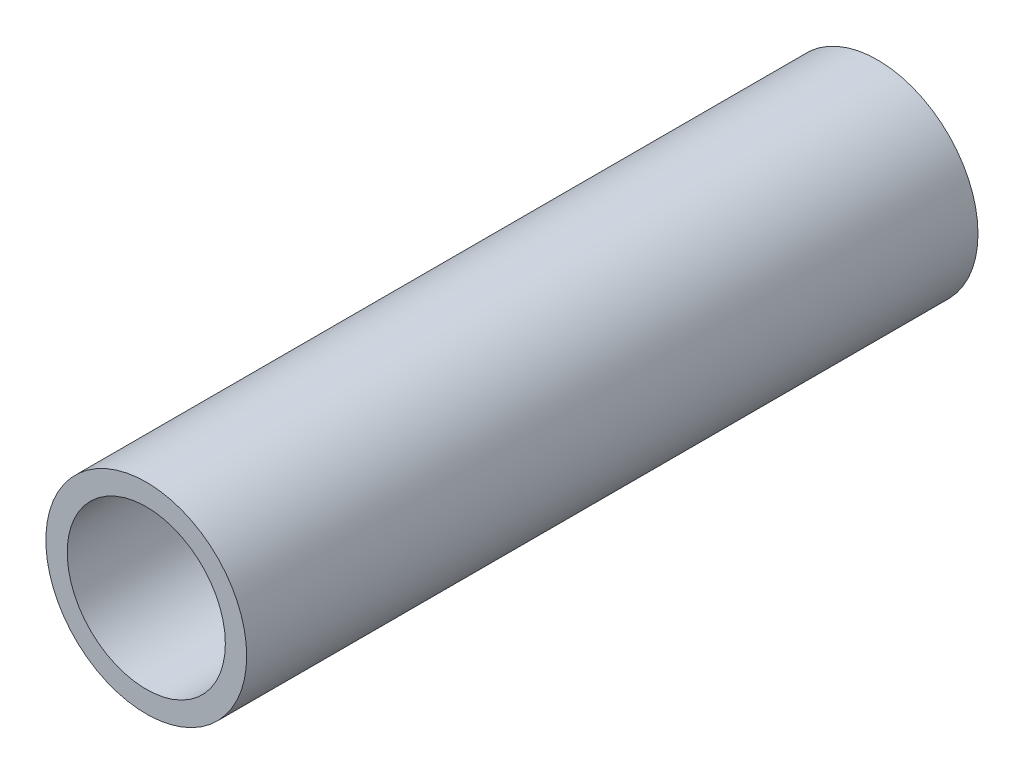
ISO-10303-21;
HEADER;
FILE_DESCRIPTION(('STEP AP214'),'2;1');
FILE_NAME('part.step','',(''),(''),'','','');
FILE_SCHEMA(('AUTOMOTIVE_DESIGN { 1 0 10303 214 1 1 1 1 }'));
ENDSEC;
DATA;
#1=APPLICATION_CONTEXT('core data for automotive mechanical design processes');
#2=APPLICATION_PROTOCOL_DEFINITION('international standard','automotive_design',2000,#1);
#3=PRODUCT_CONTEXT('',#1,'mechanical');
#4=PRODUCT('Part','Part','',(#3));
#5=PRODUCT_RELATED_PRODUCT_CATEGORY('part','',(#4));
#6=PRODUCT_DEFINITION_FORMATION('','',#4);
#7=PRODUCT_DEFINITION_CONTEXT('part definition',#1,'design');
#8=PRODUCT_DEFINITION('design','',#6,#7);
#9=PRODUCT_DEFINITION_SHAPE('','',#8);
#10=(LENGTH_UNIT() NAMED_UNIT(*) SI_UNIT(.MILLI.,.METRE.));
#11=(NAMED_UNIT(*) PLANE_ANGLE_UNIT() SI_UNIT($,.RADIAN.));
#12=(NAMED_UNIT(*) SI_UNIT($,.STERADIAN.) SOLID_ANGLE_UNIT());
#13=UNCERTAINTY_MEASURE_WITH_UNIT(LENGTH_MEASURE(1.E-05),#10,'distance_accuracy_value','');
#14=(GEOMETRIC_REPRESENTATION_CONTEXT(3) GLOBAL_UNCERTAINTY_ASSIGNED_CONTEXT((#13)) GLOBAL_UNIT_ASSIGNED_CONTEXT((#10,
#11,#12)) REPRESENTATION_CONTEXT('',''));
#15=CARTESIAN_POINT('',(0.,0.,0.));
#16=DIRECTION('',(0.,0.,1.));
#17=DIRECTION('',(1.,0.,0.));
#18=AXIS2_PLACEMENT_3D('',#15,#16,#17);
#19=CARTESIAN_POINT('',(0.,0.,29.13));
#20=DIRECTION('',(0.,0.,1.));
#21=DIRECTION('',(1.,0.,0.));
#22=AXIS2_PLACEMENT_3D('',#19,#20,#21);
#23=PLANE('',#22);
#24=CARTESIAN_POINT('',(0.,0.,29.13));
#25=DIRECTION('',(0.,0.,1.));
#26=DIRECTION('',(1.,0.,0.));
#27=AXIS2_PLACEMENT_3D('',#24,#25,#26);
#28=CIRCLE('',#27,4.);
#29=CARTESIAN_POINT('',(4.,0.,29.13));
#30=VERTEX_POINT('',#29);
#31=EDGE_CURVE('E10',#30,#30,#28,.T.);
#32=ORIENTED_EDGE('',*,*,#31,.T.);
#33=EDGE_LOOP('',(#32));
#34=FACE_BOUND('',#33,.T.);
#35=CARTESIAN_POINT('',(0.,0.,29.13));
#36=DIRECTION('',(0.,0.,1.));
#37=DIRECTION('',(1.,0.,0.));
#38=AXIS2_PLACEMENT_3D('',#35,#36,#37);
#39=CIRCLE('',#38,3.15);
#40=CARTESIAN_POINT('',(3.15,0.,29.13));
#41=VERTEX_POINT('',#40);
#42=EDGE_CURVE('E45',#41,#41,#39,.T.);
#43=ORIENTED_EDGE('',*,*,#42,.F.);
#44=EDGE_LOOP('',(#43));
#45=FACE_BOUND('',#44,.T.);
#46=ADVANCED_FACE('F34',(#34,#45),#23,.T.);
#47=CARTESIAN_POINT('',(0.,0.,0.));
#48=DIRECTION('',(0.,0.,1.));
#49=DIRECTION('',(1.,0.,0.));
#50=AXIS2_PLACEMENT_3D('',#47,#48,#49);
#51=PLANE('',#50);
#52=CARTESIAN_POINT('',(0.,0.,0.));
#53=DIRECTION('',(0.,0.,1.));
#54=DIRECTION('',(1.,0.,0.));
#55=AXIS2_PLACEMENT_3D('',#52,#53,#54);
#56=CIRCLE('',#55,4.);
#57=CARTESIAN_POINT('',(4.,0.,0.));
#58=VERTEX_POINT('',#57);
#59=EDGE_CURVE('E38',#58,#58,#56,.T.);
#60=ORIENTED_EDGE('',*,*,#59,.F.);
#61=EDGE_LOOP('',(#60));
#62=FACE_BOUND('',#61,.T.);
#63=CARTESIAN_POINT('',(0.,0.,0.));
#64=DIRECTION('',(0.,0.,1.));
#65=DIRECTION('',(1.,0.,0.));
#66=AXIS2_PLACEMENT_3D('',#63,#64,#65);
#67=CIRCLE('',#66,3.15);
#68=CARTESIAN_POINT('',(3.15,0.,0.));
#69=VERTEX_POINT('',#68);
#70=EDGE_CURVE('E47',#69,#69,#67,.T.);
#71=ORIENTED_EDGE('',*,*,#70,.T.);
#72=EDGE_LOOP('',(#71));
#73=FACE_BOUND('',#72,.T.);
#74=ADVANCED_FACE('F57',(#62,#73),#51,.F.);
#75=CARTESIAN_POINT('',(0.,0.,29.13));
#76=DIRECTION('',(0.,0.,-1.));
#77=DIRECTION('',(-1.,0.,0.));
#78=AXIS2_PLACEMENT_3D('',#75,#76,#77);
#79=CYLINDRICAL_SURFACE('',#78,4.);
#80=ORIENTED_EDGE('',*,*,#31,.F.);
#81=EDGE_LOOP('',(#80));
#82=FACE_BOUND('',#81,.T.);
#83=ORIENTED_EDGE('',*,*,#59,.T.);
#84=EDGE_LOOP('',(#83));
#85=FACE_BOUND('',#84,.T.);
#86=ADVANCED_FACE('F36',(#82,#85),#79,.T.);
#87=CARTESIAN_POINT('',(0.,0.,29.13));
#88=DIRECTION('',(0.,0.,-1.));
#89=DIRECTION('',(-1.,0.,0.));
#90=AXIS2_PLACEMENT_3D('',#87,#88,#89);
#91=CYLINDRICAL_SURFACE('',#90,3.15);
#92=ORIENTED_EDGE('',*,*,#42,.T.);
#93=EDGE_LOOP('',(#92));
#94=FACE_BOUND('',#93,.T.);
#95=ORIENTED_EDGE('',*,*,#70,.F.);
#96=EDGE_LOOP('',(#95));
#97=FACE_BOUND('',#96,.T.);
#98=ADVANCED_FACE('F53',(#94,#97),#91,.F.);
#99=CLOSED_SHELL('',(#46,#74,#86,#98));
#100=MANIFOLD_SOLID_BREP('B2',#99);
#101=ADVANCED_BREP_SHAPE_REPRESENTATION('',(#18,#100),#14);
#102=SHAPE_DEFINITION_REPRESENTATION(#9,#101);
ENDSEC;
END-ISO-10303-21;
